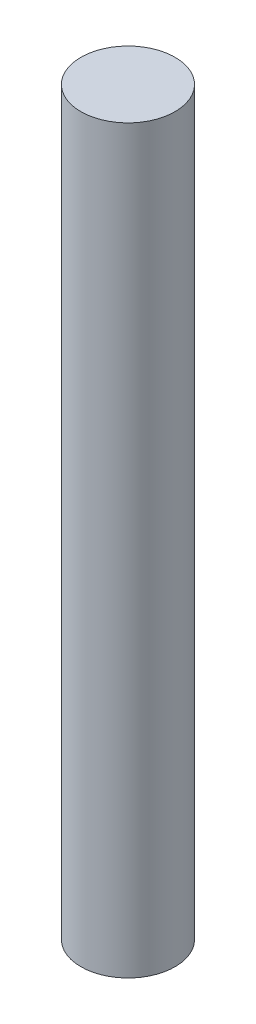
ISO-10303-21;
HEADER;
FILE_DESCRIPTION(('STEP AP214'),'2;1');
FILE_NAME('part.step','',(''),(''),'','','');
FILE_SCHEMA(('AUTOMOTIVE_DESIGN { 1 0 10303 214 1 1 1 1 }'));
ENDSEC;
DATA;
#1=APPLICATION_CONTEXT('core data for automotive mechanical design processes');
#2=APPLICATION_PROTOCOL_DEFINITION('international standard','automotive_design',2000,#1);
#3=PRODUCT_CONTEXT('',#1,'mechanical');
#4=PRODUCT('Part','Part','',(#3));
#5=PRODUCT_RELATED_PRODUCT_CATEGORY('part','',(#4));
#6=PRODUCT_DEFINITION_FORMATION('','',#4);
#7=PRODUCT_DEFINITION_CONTEXT('part definition',#1,'design');
#8=PRODUCT_DEFINITION('design','',#6,#7);
#9=PRODUCT_DEFINITION_SHAPE('','',#8);
#10=(LENGTH_UNIT() NAMED_UNIT(*) SI_UNIT(.MILLI.,.METRE.));
#11=(NAMED_UNIT(*) PLANE_ANGLE_UNIT() SI_UNIT($,.RADIAN.));
#12=(NAMED_UNIT(*) SI_UNIT($,.STERADIAN.) SOLID_ANGLE_UNIT());
#13=UNCERTAINTY_MEASURE_WITH_UNIT(LENGTH_MEASURE(1.E-05),#10,'distance_accuracy_value','');
#14=(GEOMETRIC_REPRESENTATION_CONTEXT(3) GLOBAL_UNCERTAINTY_ASSIGNED_CONTEXT((#13)) GLOBAL_UNIT_ASSIGNED_CONTEXT((#10,
#11,#12)) REPRESENTATION_CONTEXT('',''));
#15=CARTESIAN_POINT('',(0.,0.,0.));
#16=DIRECTION('',(0.,0.,1.));
#17=DIRECTION('',(1.,0.,0.));
#18=AXIS2_PLACEMENT_3D('',#15,#16,#17);
#19=CARTESIAN_POINT('',(0.,250.,0.));
#20=DIRECTION('',(0.,-1.,0.));
#21=DIRECTION('',(0.,0.,-1.));
#22=AXIS2_PLACEMENT_3D('',#19,#20,#21);
#23=CYLINDRICAL_SURFACE('',#22,15.9);
#24=CARTESIAN_POINT('',(0.,250.,0.));
#25=DIRECTION('',(0.,1.,0.));
#26=DIRECTION('',(0.,0.,1.));
#27=AXIS2_PLACEMENT_3D('',#24,#25,#26);
#28=CIRCLE('',#27,15.9);
#29=CARTESIAN_POINT('',(0.,250.,15.9));
#30=VERTEX_POINT('',#29);
#31=EDGE_CURVE('E10',#30,#30,#28,.T.);
#32=ORIENTED_EDGE('',*,*,#31,.F.);
#33=EDGE_LOOP('',(#32));
#34=FACE_BOUND('',#33,.T.);
#35=CARTESIAN_POINT('',(0.,0.,0.));
#36=DIRECTION('',(0.,1.,0.));
#37=DIRECTION('',(0.,0.,1.));
#38=AXIS2_PLACEMENT_3D('',#35,#36,#37);
#39=CIRCLE('',#38,15.9);
#40=CARTESIAN_POINT('',(0.,0.,15.9));
#41=VERTEX_POINT('',#40);
#42=EDGE_CURVE('E32',#41,#41,#39,.T.);
#43=ORIENTED_EDGE('',*,*,#42,.T.);
#44=EDGE_LOOP('',(#43));
#45=FACE_BOUND('',#44,.T.);
#46=ADVANCED_FACE('F29',(#34,#45),#23,.T.);
#47=CARTESIAN_POINT('',(0.,250.,0.));
#48=DIRECTION('',(0.,1.,0.));
#49=DIRECTION('',(0.,0.,1.));
#50=AXIS2_PLACEMENT_3D('',#47,#48,#49);
#51=PLANE('',#50);
#52=ORIENTED_EDGE('',*,*,#31,.T.);
#53=EDGE_LOOP('',(#52));
#54=FACE_BOUND('',#53,.T.);
#55=ADVANCED_FACE('F44',(#54),#51,.T.);
#56=CARTESIAN_POINT('',(0.,0.,0.));
#57=DIRECTION('',(0.,1.,0.));
#58=DIRECTION('',(0.,0.,1.));
#59=AXIS2_PLACEMENT_3D('',#56,#57,#58);
#60=PLANE('',#59);
#61=ORIENTED_EDGE('',*,*,#42,.F.);
#62=EDGE_LOOP('',(#61));
#63=FACE_BOUND('',#62,.T.);
#64=ADVANCED_FACE('F42',(#63),#60,.F.);
#65=CLOSED_SHELL('',(#46,#55,#64));
#66=MANIFOLD_SOLID_BREP('B2',#65);
#67=ADVANCED_BREP_SHAPE_REPRESENTATION('',(#18,#66),#14);
#68=SHAPE_DEFINITION_REPRESENTATION(#9,#67);
ENDSEC;
END-ISO-10303-21;
